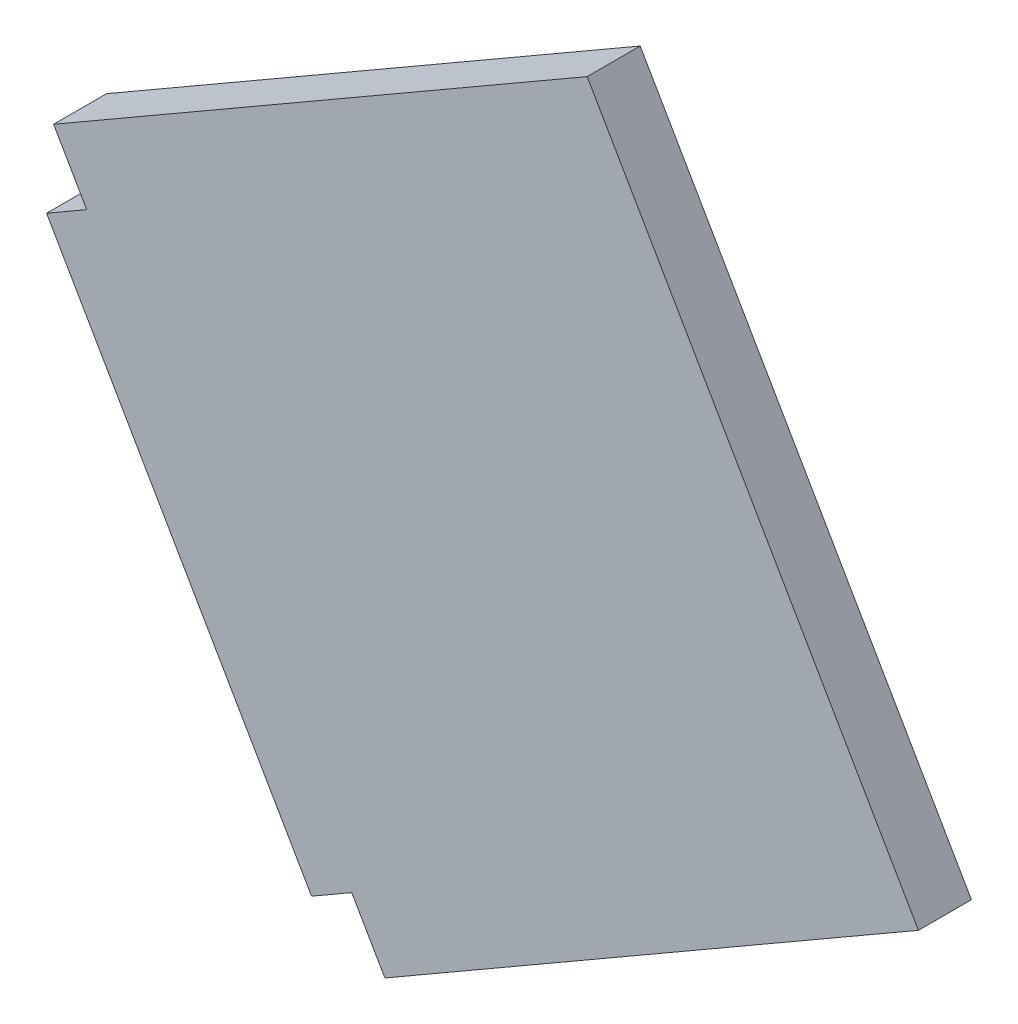
ISO-10303-21;
HEADER;
FILE_DESCRIPTION(('STEP AP214'),'2;1');
FILE_NAME('part.step','',(''),(''),'','','');
FILE_SCHEMA(('AUTOMOTIVE_DESIGN { 1 0 10303 214 1 1 1 1 }'));
ENDSEC;
DATA;
#1=APPLICATION_CONTEXT('core data for automotive mechanical design processes');
#2=APPLICATION_PROTOCOL_DEFINITION('international standard','automotive_design',2000,#1);
#3=PRODUCT_CONTEXT('',#1,'mechanical');
#4=PRODUCT('Part','Part','',(#3));
#5=PRODUCT_RELATED_PRODUCT_CATEGORY('part','',(#4));
#6=PRODUCT_DEFINITION_FORMATION('','',#4);
#7=PRODUCT_DEFINITION_CONTEXT('part definition',#1,'design');
#8=PRODUCT_DEFINITION('design','',#6,#7);
#9=PRODUCT_DEFINITION_SHAPE('','',#8);
#10=(LENGTH_UNIT() NAMED_UNIT(*) SI_UNIT(.MILLI.,.METRE.));
#11=(NAMED_UNIT(*) PLANE_ANGLE_UNIT() SI_UNIT($,.RADIAN.));
#12=(NAMED_UNIT(*) SI_UNIT($,.STERADIAN.) SOLID_ANGLE_UNIT());
#13=UNCERTAINTY_MEASURE_WITH_UNIT(LENGTH_MEASURE(1.E-05),#10,'distance_accuracy_value','');
#14=(GEOMETRIC_REPRESENTATION_CONTEXT(3) GLOBAL_UNCERTAINTY_ASSIGNED_CONTEXT((#13)) GLOBAL_UNIT_ASSIGNED_CONTEXT((#10,
#11,#12)) REPRESENTATION_CONTEXT('',''));
#15=CARTESIAN_POINT('',(0.,0.,0.));
#16=DIRECTION('',(0.,0.,1.));
#17=DIRECTION('',(1.,0.,0.));
#18=AXIS2_PLACEMENT_3D('',#15,#16,#17);
#19=CARTESIAN_POINT('',(-0.2,0.346410161513776,0.));
#20=DIRECTION('',(0.5,-0.866025403784439,0.));
#21=DIRECTION('',(0.866025403784439,0.5,0.));
#22=AXIS2_PLACEMENT_3D('',#19,#20,#21);
#23=PLANE('',#22);
#24=DIRECTION('',(0.866025403784439,0.5,0.));
#25=VECTOR('',#24,1.);
#26=CARTESIAN_POINT('',(-0.2,0.346410161513776,0.08));
#27=LINE('',#26,#25);
#28=CARTESIAN_POINT('',(0.55,0.779422863405995,0.08));
#29=VERTEX_POINT('',#28);
#30=CARTESIAN_POINT('',(0.610621778264911,0.814422863405995,0.08));
#31=VERTEX_POINT('',#30);
#32=EDGE_CURVE('E134',#29,#31,#27,.T.);
#33=ORIENTED_EDGE('',*,*,#32,.T.);
#34=DIRECTION('',(0.,0.,1.));
#35=VECTOR('',#34,1.);
#36=CARTESIAN_POINT('',(0.610621778264911,0.814422863405995,0.));
#37=LINE('',#36,#35);
#38=CARTESIAN_POINT('',(0.610621778264911,0.814422863405995,0.));
#39=VERTEX_POINT('',#38);
#40=EDGE_CURVE('E11',#39,#31,#37,.T.);
#41=ORIENTED_EDGE('',*,*,#40,.F.);
#42=DIRECTION('',(0.866025403784439,0.5,0.));
#43=VECTOR('',#42,1.);
#44=CARTESIAN_POINT('',(-0.2,0.346410161513776,0.));
#45=LINE('',#44,#43);
#46=CARTESIAN_POINT('',(0.55,0.779422863405995,0.));
#47=VERTEX_POINT('',#46);
#48=EDGE_CURVE('E55',#47,#39,#45,.T.);
#49=ORIENTED_EDGE('',*,*,#48,.F.);
#50=DIRECTION('',(0.,0.,1.));
#51=VECTOR('',#50,1.);
#52=CARTESIAN_POINT('',(0.55,0.779422863405995,0.));
#53=LINE('',#52,#51);
#54=EDGE_CURVE('E40',#47,#29,#53,.T.);
#55=ORIENTED_EDGE('',*,*,#54,.T.);
#56=EDGE_LOOP('',(#33,#41,#49,#55));
#57=FACE_BOUND('',#56,.T.);
#58=ADVANCED_FACE('F37',(#57),#23,.F.);
#59=CARTESIAN_POINT('',(0.810621778264911,0.46801270189222,0.));
#60=DIRECTION('',(-0.866025403784438,-0.500000000000001,0.));
#61=DIRECTION('',(0.500000000000001,-0.866025403784438,0.));
#62=AXIS2_PLACEMENT_3D('',#59,#60,#61);
#63=PLANE('',#62);
#64=DIRECTION('',(0.500000000000001,-0.866025403784438,0.));
#65=VECTOR('',#64,1.);
#66=CARTESIAN_POINT('',(0.810621778264911,0.46801270189222,0.08));
#67=LINE('',#66,#65);
#68=CARTESIAN_POINT('',(0.56062177826491,0.901025403784439,0.08));
#69=VERTEX_POINT('',#68);
#70=EDGE_CURVE('E150',#69,#31,#67,.T.);
#71=ORIENTED_EDGE('',*,*,#70,.F.);
#72=DIRECTION('',(0.,0.,1.));
#73=VECTOR('',#72,1.);
#74=CARTESIAN_POINT('',(0.56062177826491,0.901025403784439,0.));
#75=LINE('',#74,#73);
#76=CARTESIAN_POINT('',(0.56062177826491,0.901025403784439,0.));
#77=VERTEX_POINT('',#76);
#78=EDGE_CURVE('E46',#77,#69,#75,.T.);
#79=ORIENTED_EDGE('',*,*,#78,.F.);
#80=DIRECTION('',(0.500000000000001,-0.866025403784438,0.));
#81=VECTOR('',#80,1.);
#82=CARTESIAN_POINT('',(0.810621778264911,0.46801270189222,0.));
#83=LINE('',#82,#81);
#84=EDGE_CURVE('E114',#77,#39,#83,.T.);
#85=ORIENTED_EDGE('',*,*,#84,.T.);
#86=ORIENTED_EDGE('',*,*,#40,.T.);
#87=EDGE_LOOP('',(#71,#79,#85,#86));
#88=FACE_BOUND('',#87,.T.);
#89=ADVANCED_FACE('F167',(#88),#63,.T.);
#90=CARTESIAN_POINT('',(-0.25,0.433012701892219,0.));
#91=DIRECTION('',(0.5,-0.866025403784438,0.));
#92=DIRECTION('',(0.866025403784439,0.5,0.));
#93=AXIS2_PLACEMENT_3D('',#90,#91,#92);
#94=PLANE('',#93);
#95=DIRECTION('',(0.866025403784438,0.5,0.));
#96=VECTOR('',#95,1.);
#97=CARTESIAN_POINT('',(-0.25,0.433012701892219,0.08));
#98=LINE('',#97,#96);
#99=CARTESIAN_POINT('',(1.36602540378444,1.36602540378444,0.08));
#100=VERTEX_POINT('',#99);
#101=EDGE_CURVE('E119',#69,#100,#98,.T.);
#102=ORIENTED_EDGE('',*,*,#101,.T.);
#103=DIRECTION('',(0.,0.,1.));
#104=VECTOR('',#103,1.);
#105=CARTESIAN_POINT('',(1.36602540378444,1.36602540378444,0.));
#106=LINE('',#105,#104);
#107=CARTESIAN_POINT('',(1.36602540378444,1.36602540378444,0.));
#108=VERTEX_POINT('',#107);
#109=EDGE_CURVE('E117',#108,#100,#106,.T.);
#110=ORIENTED_EDGE('',*,*,#109,.F.);
#111=DIRECTION('',(0.866025403784438,0.5,0.));
#112=VECTOR('',#111,1.);
#113=CARTESIAN_POINT('',(-0.25,0.433012701892219,0.));
#114=LINE('',#113,#112);
#115=EDGE_CURVE('E107',#77,#108,#114,.T.);
#116=ORIENTED_EDGE('',*,*,#115,.F.);
#117=ORIENTED_EDGE('',*,*,#78,.T.);
#118=EDGE_LOOP('',(#102,#110,#116,#117));
#119=FACE_BOUND('',#118,.T.);
#120=ADVANCED_FACE('F118',(#119),#94,.F.);
#121=CARTESIAN_POINT('',(1.61602540378444,0.93301270189222,0.));
#122=DIRECTION('',(-0.866025403784438,-0.500000000000001,0.));
#123=DIRECTION('',(0.500000000000001,-0.866025403784438,0.));
#124=AXIS2_PLACEMENT_3D('',#121,#122,#123);
#125=PLANE('',#124);
#126=DIRECTION('',(0.500000000000001,-0.866025403784438,0.));
#127=VECTOR('',#126,1.);
#128=CARTESIAN_POINT('',(1.61602540378444,0.93301270189222,0.08));
#129=LINE('',#128,#127);
#130=CARTESIAN_POINT('',(1.86602540378444,0.500000000000001,0.08));
#131=VERTEX_POINT('',#130);
#132=EDGE_CURVE('E147',#100,#131,#129,.T.);
#133=ORIENTED_EDGE('',*,*,#132,.T.);
#134=DIRECTION('',(0.,0.,1.));
#135=VECTOR('',#134,1.);
#136=CARTESIAN_POINT('',(1.86602540378444,0.500000000000001,0.));
#137=LINE('',#136,#135);
#138=CARTESIAN_POINT('',(1.86602540378444,0.500000000000001,0.));
#139=VERTEX_POINT('',#138);
#140=EDGE_CURVE('E123',#139,#131,#137,.T.);
#141=ORIENTED_EDGE('',*,*,#140,.F.);
#142=DIRECTION('',(0.500000000000001,-0.866025403784438,0.));
#143=VECTOR('',#142,1.);
#144=CARTESIAN_POINT('',(1.61602540378444,0.93301270189222,0.));
#145=LINE('',#144,#143);
#146=EDGE_CURVE('E112',#108,#139,#145,.T.);
#147=ORIENTED_EDGE('',*,*,#146,.F.);
#148=ORIENTED_EDGE('',*,*,#109,.T.);
#149=EDGE_LOOP('',(#133,#141,#147,#148));
#150=FACE_BOUND('',#149,.T.);
#151=ADVANCED_FACE('F125',(#150),#125,.F.);
#152=CARTESIAN_POINT('',(0.250000000000001,-0.43301270189222,0.));
#153=DIRECTION('',(0.500000000000001,-0.866025403784438,0.));
#154=DIRECTION('',(0.866025403784438,0.500000000000001,0.));
#155=AXIS2_PLACEMENT_3D('',#152,#153,#154);
#156=PLANE('',#155);
#157=DIRECTION('',(0.866025403784438,0.500000000000001,0.));
#158=VECTOR('',#157,1.);
#159=CARTESIAN_POINT('',(0.250000000000001,-0.43301270189222,0.08));
#160=LINE('',#159,#158);
#161=CARTESIAN_POINT('',(1.06062177826491,0.0350000000000003,0.08));
#162=VERTEX_POINT('',#161);
#163=EDGE_CURVE('E144',#162,#131,#160,.T.);
#164=ORIENTED_EDGE('',*,*,#163,.F.);
#165=DIRECTION('',(0.,0.,1.));
#166=VECTOR('',#165,1.);
#167=CARTESIAN_POINT('',(1.06062177826491,0.0350000000000003,0.));
#168=LINE('',#167,#166);
#169=CARTESIAN_POINT('',(1.06062177826491,0.0350000000000003,0.));
#170=VERTEX_POINT('',#169);
#171=EDGE_CURVE('E155',#170,#162,#168,.T.);
#172=ORIENTED_EDGE('',*,*,#171,.F.);
#173=DIRECTION('',(0.866025403784438,0.500000000000001,0.));
#174=VECTOR('',#173,1.);
#175=CARTESIAN_POINT('',(0.250000000000001,-0.43301270189222,0.));
#176=LINE('',#175,#174);
#177=EDGE_CURVE('E127',#170,#139,#176,.T.);
#178=ORIENTED_EDGE('',*,*,#177,.T.);
#179=ORIENTED_EDGE('',*,*,#140,.T.);
#180=EDGE_LOOP('',(#164,#172,#178,#179));
#181=FACE_BOUND('',#180,.T.);
#182=ADVANCED_FACE('F180',(#181),#156,.T.);
#183=CARTESIAN_POINT('',(0.81062177826491,0.46801270189222,0.));
#184=DIRECTION('',(0.866025403784438,0.500000000000001,0.));
#185=DIRECTION('',(-0.500000000000001,0.866025403784438,0.));
#186=AXIS2_PLACEMENT_3D('',#183,#184,#185);
#187=PLANE('',#186);
#188=DIRECTION('',(-0.500000000000001,0.866025403784438,0.));
#189=VECTOR('',#188,1.);
#190=CARTESIAN_POINT('',(0.81062177826491,0.46801270189222,0.08));
#191=LINE('',#190,#189);
#192=CARTESIAN_POINT('',(1.01062177826491,0.121602540378444,0.08));
#193=VERTEX_POINT('',#192);
#194=EDGE_CURVE('E141',#162,#193,#191,.T.);
#195=ORIENTED_EDGE('',*,*,#194,.T.);
#196=DIRECTION('',(0.,0.,1.));
#197=VECTOR('',#196,1.);
#198=CARTESIAN_POINT('',(1.01062177826491,0.121602540378444,0.));
#199=LINE('',#198,#197);
#200=CARTESIAN_POINT('',(1.01062177826491,0.121602540378444,0.));
#201=VERTEX_POINT('',#200);
#202=EDGE_CURVE('E157',#201,#193,#199,.T.);
#203=ORIENTED_EDGE('',*,*,#202,.F.);
#204=DIRECTION('',(-0.500000000000001,0.866025403784438,0.));
#205=VECTOR('',#204,1.);
#206=CARTESIAN_POINT('',(0.81062177826491,0.46801270189222,0.));
#207=LINE('',#206,#205);
#208=EDGE_CURVE('E129',#170,#201,#207,.T.);
#209=ORIENTED_EDGE('',*,*,#208,.F.);
#210=ORIENTED_EDGE('',*,*,#171,.T.);
#211=EDGE_LOOP('',(#195,#203,#209,#210));
#212=FACE_BOUND('',#211,.T.);
#213=ADVANCED_FACE('F183',(#212),#187,.F.);
#214=CARTESIAN_POINT('',(0.199999999999999,-0.346410161513775,0.));
#215=DIRECTION('',(0.499999999999999,-0.866025403784439,0.));
#216=DIRECTION('',(0.866025403784439,0.499999999999999,0.));
#217=AXIS2_PLACEMENT_3D('',#214,#215,#216);
#218=PLANE('',#217);
#219=DIRECTION('',(0.866025403784439,0.499999999999999,0.));
#220=VECTOR('',#219,1.);
#221=CARTESIAN_POINT('',(0.199999999999999,-0.346410161513775,0.08));
#222=LINE('',#221,#220);
#223=CARTESIAN_POINT('',(0.95,0.0866025403784444,0.08));
#224=VERTEX_POINT('',#223);
#225=EDGE_CURVE('E138',#224,#193,#222,.T.);
#226=ORIENTED_EDGE('',*,*,#225,.F.);
#227=DIRECTION('',(0.,0.,1.));
#228=VECTOR('',#227,1.);
#229=CARTESIAN_POINT('',(0.95,0.0866025403784444,0.));
#230=LINE('',#229,#228);
#231=CARTESIAN_POINT('',(0.95,0.0866025403784444,0.));
#232=VERTEX_POINT('',#231);
#233=EDGE_CURVE('E158',#232,#224,#230,.T.);
#234=ORIENTED_EDGE('',*,*,#233,.F.);
#235=DIRECTION('',(0.866025403784439,0.499999999999999,0.));
#236=VECTOR('',#235,1.);
#237=CARTESIAN_POINT('',(0.199999999999999,-0.346410161513775,0.));
#238=LINE('',#237,#236);
#239=EDGE_CURVE('E261',#232,#201,#238,.T.);
#240=ORIENTED_EDGE('',*,*,#239,.T.);
#241=ORIENTED_EDGE('',*,*,#202,.T.);
#242=EDGE_LOOP('',(#226,#234,#240,#241));
#243=FACE_BOUND('',#242,.T.);
#244=ADVANCED_FACE('F187',(#243),#218,.T.);
#245=CARTESIAN_POINT('',(0.75,0.43301270189222,0.));
#246=DIRECTION('',(0.866025403784439,0.5,0.));
#247=DIRECTION('',(-0.5,0.866025403784439,0.));
#248=AXIS2_PLACEMENT_3D('',#245,#246,#247);
#249=PLANE('',#248);
#250=DIRECTION('',(-0.5,0.866025403784439,0.));
#251=VECTOR('',#250,1.);
#252=CARTESIAN_POINT('',(0.75,0.43301270189222,0.08));
#253=LINE('',#252,#251);
#254=EDGE_CURVE('E136',#224,#29,#253,.T.);
#255=ORIENTED_EDGE('',*,*,#254,.T.);
#256=ORIENTED_EDGE('',*,*,#54,.F.);
#257=DIRECTION('',(-0.5,0.866025403784439,0.));
#258=VECTOR('',#257,1.);
#259=CARTESIAN_POINT('',(0.75,0.43301270189222,0.));
#260=LINE('',#259,#258);
#261=EDGE_CURVE('E93',#232,#47,#260,.T.);
#262=ORIENTED_EDGE('',*,*,#261,.F.);
#263=ORIENTED_EDGE('',*,*,#233,.T.);
#264=EDGE_LOOP('',(#255,#256,#262,#263));
#265=FACE_BOUND('',#264,.T.);
#266=ADVANCED_FACE('F190',(#265),#249,.F.);
#267=CARTESIAN_POINT('',(0.,0.,0.));
#268=DIRECTION('',(0.,0.,1.));
#269=DIRECTION('',(1.,0.,0.));
#270=AXIS2_PLACEMENT_3D('',#267,#268,#269);
#271=PLANE('',#270);
#272=ORIENTED_EDGE('',*,*,#48,.T.);
#273=ORIENTED_EDGE('',*,*,#84,.F.);
#274=ORIENTED_EDGE('',*,*,#115,.T.);
#275=ORIENTED_EDGE('',*,*,#146,.T.);
#276=ORIENTED_EDGE('',*,*,#177,.F.);
#277=ORIENTED_EDGE('',*,*,#208,.T.);
#278=ORIENTED_EDGE('',*,*,#239,.F.);
#279=ORIENTED_EDGE('',*,*,#261,.T.);
#280=EDGE_LOOP('',(#272,#273,#274,#275,#276,#277,#278,#279));
#281=FACE_BOUND('',#280,.T.);
#282=ADVANCED_FACE('F109',(#281),#271,.F.);
#283=CARTESIAN_POINT('',(0.,0.,0.08));
#284=DIRECTION('',(0.,0.,1.));
#285=DIRECTION('',(1.,0.,0.));
#286=AXIS2_PLACEMENT_3D('',#283,#284,#285);
#287=PLANE('',#286);
#288=ORIENTED_EDGE('',*,*,#32,.F.);
#289=ORIENTED_EDGE('',*,*,#254,.F.);
#290=ORIENTED_EDGE('',*,*,#225,.T.);
#291=ORIENTED_EDGE('',*,*,#194,.F.);
#292=ORIENTED_EDGE('',*,*,#163,.T.);
#293=ORIENTED_EDGE('',*,*,#132,.F.);
#294=ORIENTED_EDGE('',*,*,#101,.F.);
#295=ORIENTED_EDGE('',*,*,#70,.T.);
#296=EDGE_LOOP('',(#288,#289,#290,#291,#292,#293,#294,#295));
#297=FACE_BOUND('',#296,.T.);
#298=ADVANCED_FACE('F165',(#297),#287,.T.);
#299=CLOSED_SHELL('',(#58,#89,#120,#151,#182,#213,#244,#266,#282,#298));
#300=MANIFOLD_SOLID_BREP('B2',#299);
#301=ADVANCED_BREP_SHAPE_REPRESENTATION('',(#18,#300),#14);
#302=SHAPE_DEFINITION_REPRESENTATION(#9,#301);
ENDSEC;
END-ISO-10303-21;
